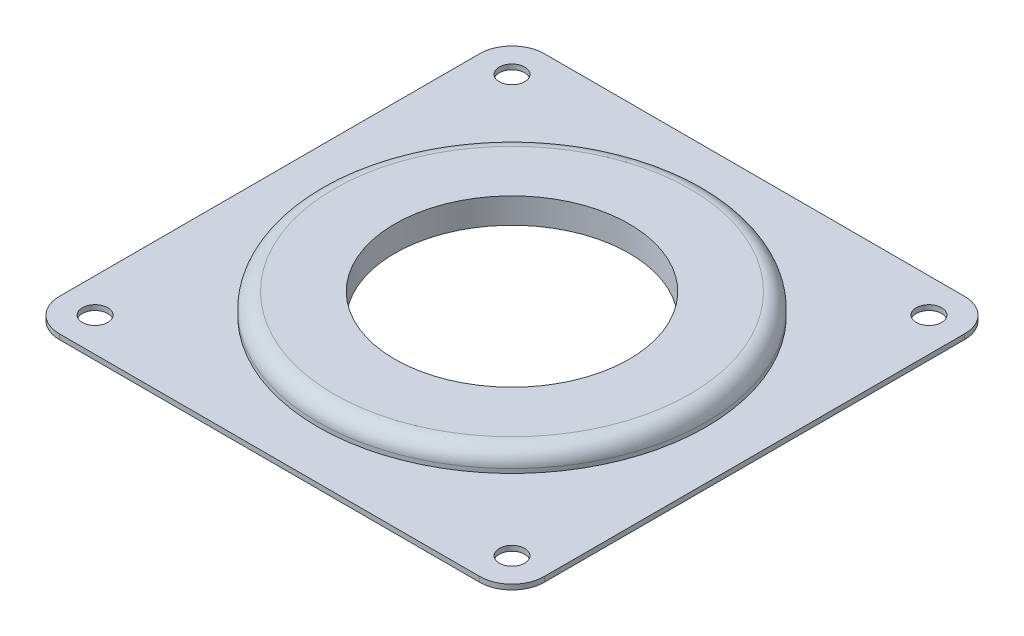
ISO-10303-21;
HEADER;
FILE_DESCRIPTION(('STEP AP214'),'2;1');
FILE_NAME('part.step','',(''),(''),'','','');
FILE_SCHEMA(('AUTOMOTIVE_DESIGN { 1 0 10303 214 1 1 1 1 }'));
ENDSEC;
DATA;
#1=APPLICATION_CONTEXT('core data for automotive mechanical design processes');
#2=APPLICATION_PROTOCOL_DEFINITION('international standard','automotive_design',2000,#1);
#3=PRODUCT_CONTEXT('',#1,'mechanical');
#4=PRODUCT('Part','Part','',(#3));
#5=PRODUCT_RELATED_PRODUCT_CATEGORY('part','',(#4));
#6=PRODUCT_DEFINITION_FORMATION('','',#4);
#7=PRODUCT_DEFINITION_CONTEXT('part definition',#1,'design');
#8=PRODUCT_DEFINITION('design','',#6,#7);
#9=PRODUCT_DEFINITION_SHAPE('','',#8);
#10=(LENGTH_UNIT() NAMED_UNIT(*) SI_UNIT(.MILLI.,.METRE.));
#11=(NAMED_UNIT(*) PLANE_ANGLE_UNIT() SI_UNIT($,.RADIAN.));
#12=(NAMED_UNIT(*) SI_UNIT($,.STERADIAN.) SOLID_ANGLE_UNIT());
#13=UNCERTAINTY_MEASURE_WITH_UNIT(LENGTH_MEASURE(1.E-05),#10,'distance_accuracy_value','');
#14=(GEOMETRIC_REPRESENTATION_CONTEXT(3) GLOBAL_UNCERTAINTY_ASSIGNED_CONTEXT((#13)) GLOBAL_UNIT_ASSIGNED_CONTEXT((#10,
#11,#12)) REPRESENTATION_CONTEXT('',''));
#15=CARTESIAN_POINT('',(0.,0.,0.));
#16=DIRECTION('',(0.,0.,1.));
#17=DIRECTION('',(1.,0.,0.));
#18=AXIS2_PLACEMENT_3D('',#15,#16,#17);
#19=CARTESIAN_POINT('',(0.,0.8,0.));
#20=DIRECTION('',(0.,-1.,0.));
#21=DIRECTION('',(0.,0.,-1.));
#22=AXIS2_PLACEMENT_3D('',#19,#20,#21);
#23=PLANE('',#22);
#24=CARTESIAN_POINT('',(0.,0.8,0.));
#25=DIRECTION('',(0.,1.,0.));
#26=DIRECTION('',(0.,0.,1.));
#27=AXIS2_PLACEMENT_3D('',#24,#25,#26);
#28=CIRCLE('',#27,30.48);
#29=CARTESIAN_POINT('',(0.,0.8,30.48));
#30=VERTEX_POINT('',#29);
#31=EDGE_CURVE('E163',#30,#30,#28,.T.);
#32=ORIENTED_EDGE('',*,*,#31,.F.);
#33=EDGE_LOOP('',(#32));
#34=FACE_BOUND('',#33,.T.);
#35=DIRECTION('',(0.,0.,-1.));
#36=VECTOR('',#35,1.);
#37=CARTESIAN_POINT('',(38.1,0.8,38.1));
#38=LINE('',#37,#36);
#39=CARTESIAN_POINT('',(38.1,0.8,33.02));
#40=VERTEX_POINT('',#39);
#41=CARTESIAN_POINT('',(38.1,0.8,-33.02));
#42=VERTEX_POINT('',#41);
#43=EDGE_CURVE('E139',#40,#42,#38,.T.);
#44=ORIENTED_EDGE('',*,*,#43,.T.);
#45=CARTESIAN_POINT('',(33.02,0.8,-33.02));
#46=DIRECTION('',(0.,-1.,0.));
#47=DIRECTION('',(0.,0.,-1.));
#48=AXIS2_PLACEMENT_3D('',#45,#46,#47);
#49=CIRCLE('',#48,5.08);
#50=CARTESIAN_POINT('',(33.02,0.8,-38.1));
#51=VERTEX_POINT('',#50);
#52=EDGE_CURVE('E153',#42,#51,#49,.F.);
#53=ORIENTED_EDGE('',*,*,#52,.T.);
#54=DIRECTION('',(-1.,0.,0.));
#55=VECTOR('',#54,1.);
#56=CARTESIAN_POINT('',(-38.1,0.8,-38.1));
#57=LINE('',#56,#55);
#58=CARTESIAN_POINT('',(-33.02,0.8,-38.1));
#59=VERTEX_POINT('',#58);
#60=EDGE_CURVE('E120',#51,#59,#57,.T.);
#61=ORIENTED_EDGE('',*,*,#60,.T.);
#62=CARTESIAN_POINT('',(-33.02,0.8,-33.02));
#63=DIRECTION('',(0.,-1.,0.));
#64=DIRECTION('',(0.,0.,-1.));
#65=AXIS2_PLACEMENT_3D('',#62,#63,#64);
#66=CIRCLE('',#65,5.08);
#67=CARTESIAN_POINT('',(-38.1,0.8,-33.02));
#68=VERTEX_POINT('',#67);
#69=EDGE_CURVE('E149',#59,#68,#66,.F.);
#70=ORIENTED_EDGE('',*,*,#69,.T.);
#71=DIRECTION('',(0.,0.,1.));
#72=VECTOR('',#71,1.);
#73=CARTESIAN_POINT('',(-38.1,0.8,38.1));
#74=LINE('',#73,#72);
#75=CARTESIAN_POINT('',(-38.1,0.8,33.02));
#76=VERTEX_POINT('',#75);
#77=EDGE_CURVE('E203',#68,#76,#74,.T.);
#78=ORIENTED_EDGE('',*,*,#77,.T.);
#79=CARTESIAN_POINT('',(-33.02,0.8,33.02));
#80=DIRECTION('',(0.,-1.,0.));
#81=DIRECTION('',(0.,0.,-1.));
#82=AXIS2_PLACEMENT_3D('',#79,#80,#81);
#83=CIRCLE('',#82,5.08);
#84=CARTESIAN_POINT('',(-33.02,0.8,38.1));
#85=VERTEX_POINT('',#84);
#86=EDGE_CURVE('E55',#76,#85,#83,.F.);
#87=ORIENTED_EDGE('',*,*,#86,.T.);
#88=DIRECTION('',(1.,0.,0.));
#89=VECTOR('',#88,1.);
#90=CARTESIAN_POINT('',(-38.1,0.8,38.1));
#91=LINE('',#90,#89);
#92=CARTESIAN_POINT('',(33.02,0.8,38.1));
#93=VERTEX_POINT('',#92);
#94=EDGE_CURVE('E140',#85,#93,#91,.T.);
#95=ORIENTED_EDGE('',*,*,#94,.T.);
#96=CARTESIAN_POINT('',(33.02,0.8,33.02));
#97=DIRECTION('',(0.,-1.,0.));
#98=DIRECTION('',(0.,0.,-1.));
#99=AXIS2_PLACEMENT_3D('',#96,#97,#98);
#100=CIRCLE('',#99,5.08);
#101=EDGE_CURVE('E151',#93,#40,#100,.F.);
#102=ORIENTED_EDGE('',*,*,#101,.T.);
#103=EDGE_LOOP('',(#44,#53,#61,#70,#78,#87,#95,#102));
#104=FACE_BOUND('',#103,.T.);
#105=CARTESIAN_POINT('',(-32.75,0.8,-32.75));
#106=DIRECTION('',(0.,1.,0.));
#107=DIRECTION('',(0.,0.,1.));
#108=AXIS2_PLACEMENT_3D('',#105,#106,#107);
#109=CIRCLE('',#108,2.000000064);
#110=CARTESIAN_POINT('',(-32.75,0.8,-30.749999936));
#111=VERTEX_POINT('',#110);
#112=EDGE_CURVE('E134',#111,#111,#109,.T.);
#113=ORIENTED_EDGE('',*,*,#112,.F.);
#114=EDGE_LOOP('',(#113));
#115=FACE_BOUND('',#114,.T.);
#116=CARTESIAN_POINT('',(32.75,0.8,-32.75));
#117=DIRECTION('',(0.,1.,0.));
#118=DIRECTION('',(0.,0.,1.));
#119=AXIS2_PLACEMENT_3D('',#116,#117,#118);
#120=CIRCLE('',#119,2.000000064);
#121=CARTESIAN_POINT('',(32.75,0.8,-30.749999936));
#122=VERTEX_POINT('',#121);
#123=EDGE_CURVE('E190',#122,#122,#120,.T.);
#124=ORIENTED_EDGE('',*,*,#123,.F.);
#125=EDGE_LOOP('',(#124));
#126=FACE_BOUND('',#125,.T.);
#127=CARTESIAN_POINT('',(32.75,0.8,32.75));
#128=DIRECTION('',(0.,1.,0.));
#129=DIRECTION('',(0.,0.,1.));
#130=AXIS2_PLACEMENT_3D('',#127,#128,#129);
#131=CIRCLE('',#130,2.000000064);
#132=CARTESIAN_POINT('',(32.75,0.8,34.750000064));
#133=VERTEX_POINT('',#132);
#134=EDGE_CURVE('E184',#133,#133,#131,.T.);
#135=ORIENTED_EDGE('',*,*,#134,.F.);
#136=EDGE_LOOP('',(#135));
#137=FACE_BOUND('',#136,.T.);
#138=CARTESIAN_POINT('',(-32.75,0.8,32.75));
#139=DIRECTION('',(0.,1.,0.));
#140=DIRECTION('',(0.,0.,1.));
#141=AXIS2_PLACEMENT_3D('',#138,#139,#140);
#142=CIRCLE('',#141,2.000000064);
#143=CARTESIAN_POINT('',(-32.75,0.8,34.750000064));
#144=VERTEX_POINT('',#143);
#145=EDGE_CURVE('E178',#144,#144,#142,.T.);
#146=ORIENTED_EDGE('',*,*,#145,.F.);
#147=EDGE_LOOP('',(#146));
#148=FACE_BOUND('',#147,.T.);
#149=ADVANCED_FACE('F33',(#34,#104,#115,#126,#137,#148),#23,.F.);
#150=CARTESIAN_POINT('',(0.,0.,0.));
#151=DIRECTION('',(0.,-1.,0.));
#152=DIRECTION('',(0.,0.,-1.));
#153=AXIS2_PLACEMENT_3D('',#150,#151,#152);
#154=PLANE('',#153);
#155=CARTESIAN_POINT('',(-32.75,0.,32.75));
#156=DIRECTION('',(0.,1.,0.));
#157=DIRECTION('',(0.,0.,1.));
#158=AXIS2_PLACEMENT_3D('',#155,#156,#157);
#159=CIRCLE('',#158,2.000000064);
#160=CARTESIAN_POINT('',(-32.75,0.,34.750000064));
#161=VERTEX_POINT('',#160);
#162=EDGE_CURVE('E177',#161,#161,#159,.T.);
#163=ORIENTED_EDGE('',*,*,#162,.T.);
#164=EDGE_LOOP('',(#163));
#165=FACE_BOUND('',#164,.T.);
#166=CARTESIAN_POINT('',(32.75,0.,-32.75));
#167=DIRECTION('',(0.,1.,0.));
#168=DIRECTION('',(0.,0.,1.));
#169=AXIS2_PLACEMENT_3D('',#166,#167,#168);
#170=CIRCLE('',#169,2.000000064);
#171=CARTESIAN_POINT('',(32.75,0.,-30.749999936));
#172=VERTEX_POINT('',#171);
#173=EDGE_CURVE('E187',#172,#172,#170,.T.);
#174=ORIENTED_EDGE('',*,*,#173,.T.);
#175=EDGE_LOOP('',(#174));
#176=FACE_BOUND('',#175,.T.);
#177=DIRECTION('',(-1.,0.,0.));
#178=VECTOR('',#177,1.);
#179=CARTESIAN_POINT('',(-38.1,0.,-38.1));
#180=LINE('',#179,#178);
#181=CARTESIAN_POINT('',(33.02,0.,-38.1));
#182=VERTEX_POINT('',#181);
#183=CARTESIAN_POINT('',(-33.02,0.,-38.1));
#184=VERTEX_POINT('',#183);
#185=EDGE_CURVE('E117',#182,#184,#180,.T.);
#186=ORIENTED_EDGE('',*,*,#185,.F.);
#187=CARTESIAN_POINT('',(33.02,0.,-33.02));
#188=DIRECTION('',(0.,-1.,0.));
#189=DIRECTION('',(0.,0.,-1.));
#190=AXIS2_PLACEMENT_3D('',#187,#188,#189);
#191=CIRCLE('',#190,5.08);
#192=CARTESIAN_POINT('',(38.1,0.,-33.02));
#193=VERTEX_POINT('',#192);
#194=EDGE_CURVE('E100',#182,#193,#191,.T.);
#195=ORIENTED_EDGE('',*,*,#194,.T.);
#196=DIRECTION('',(0.,0.,-1.));
#197=VECTOR('',#196,1.);
#198=CARTESIAN_POINT('',(38.1,0.,38.1));
#199=LINE('',#198,#197);
#200=CARTESIAN_POINT('',(38.1,0.,33.02));
#201=VERTEX_POINT('',#200);
#202=EDGE_CURVE('E129',#201,#193,#199,.T.);
#203=ORIENTED_EDGE('',*,*,#202,.F.);
#204=CARTESIAN_POINT('',(33.02,0.,33.02));
#205=DIRECTION('',(0.,-1.,0.));
#206=DIRECTION('',(0.,0.,-1.));
#207=AXIS2_PLACEMENT_3D('',#204,#205,#206);
#208=CIRCLE('',#207,5.08);
#209=CARTESIAN_POINT('',(33.02,0.,38.1));
#210=VERTEX_POINT('',#209);
#211=EDGE_CURVE('E111',#201,#210,#208,.T.);
#212=ORIENTED_EDGE('',*,*,#211,.T.);
#213=DIRECTION('',(1.,0.,0.));
#214=VECTOR('',#213,1.);
#215=CARTESIAN_POINT('',(-38.1,0.,38.1));
#216=LINE('',#215,#214);
#217=CARTESIAN_POINT('',(-33.02,0.,38.1));
#218=VERTEX_POINT('',#217);
#219=EDGE_CURVE('E132',#218,#210,#216,.T.);
#220=ORIENTED_EDGE('',*,*,#219,.F.);
#221=CARTESIAN_POINT('',(-33.02,0.,33.02));
#222=DIRECTION('',(0.,-1.,0.));
#223=DIRECTION('',(0.,0.,-1.));
#224=AXIS2_PLACEMENT_3D('',#221,#222,#223);
#225=CIRCLE('',#224,5.08);
#226=CARTESIAN_POINT('',(-38.1,0.,33.02));
#227=VERTEX_POINT('',#226);
#228=EDGE_CURVE('E121',#218,#227,#225,.T.);
#229=ORIENTED_EDGE('',*,*,#228,.T.);
#230=DIRECTION('',(0.,0.,1.));
#231=VECTOR('',#230,1.);
#232=CARTESIAN_POINT('',(-38.1,0.,38.1));
#233=LINE('',#232,#231);
#234=CARTESIAN_POINT('',(-38.1,0.,-33.02));
#235=VERTEX_POINT('',#234);
#236=EDGE_CURVE('E128',#235,#227,#233,.T.);
#237=ORIENTED_EDGE('',*,*,#236,.F.);
#238=CARTESIAN_POINT('',(-33.02,0.,-33.02));
#239=DIRECTION('',(0.,-1.,0.));
#240=DIRECTION('',(0.,0.,-1.));
#241=AXIS2_PLACEMENT_3D('',#238,#239,#240);
#242=CIRCLE('',#241,5.08);
#243=EDGE_CURVE('E127',#235,#184,#242,.T.);
#244=ORIENTED_EDGE('',*,*,#243,.T.);
#245=EDGE_LOOP('',(#186,#195,#203,#212,#220,#229,#237,#244));
#246=FACE_BOUND('',#245,.T.);
#247=CARTESIAN_POINT('',(-32.75,0.,-32.75));
#248=DIRECTION('',(0.,1.,0.));
#249=DIRECTION('',(0.,0.,1.));
#250=AXIS2_PLACEMENT_3D('',#247,#248,#249);
#251=CIRCLE('',#250,2.000000064);
#252=CARTESIAN_POINT('',(-32.75,0.,-30.749999936));
#253=VERTEX_POINT('',#252);
#254=EDGE_CURVE('E193',#253,#253,#251,.T.);
#255=ORIENTED_EDGE('',*,*,#254,.T.);
#256=EDGE_LOOP('',(#255));
#257=FACE_BOUND('',#256,.T.);
#258=CARTESIAN_POINT('',(32.75,0.,32.75));
#259=DIRECTION('',(0.,1.,0.));
#260=DIRECTION('',(0.,0.,1.));
#261=AXIS2_PLACEMENT_3D('',#258,#259,#260);
#262=CIRCLE('',#261,2.000000064);
#263=CARTESIAN_POINT('',(32.75,0.,34.750000064));
#264=VERTEX_POINT('',#263);
#265=EDGE_CURVE('E181',#264,#264,#262,.T.);
#266=ORIENTED_EDGE('',*,*,#265,.T.);
#267=EDGE_LOOP('',(#266));
#268=FACE_BOUND('',#267,.T.);
#269=CARTESIAN_POINT('',(0.,0.,0.));
#270=DIRECTION('',(0.,1.,0.));
#271=DIRECTION('',(0.,0.,1.));
#272=AXIS2_PLACEMENT_3D('',#269,#270,#271);
#273=CIRCLE('',#272,18.415);
#274=CARTESIAN_POINT('',(0.,0.,18.415));
#275=VERTEX_POINT('',#274);
#276=EDGE_CURVE('E174',#275,#275,#273,.T.);
#277=ORIENTED_EDGE('',*,*,#276,.T.);
#278=EDGE_LOOP('',(#277));
#279=FACE_BOUND('',#278,.T.);
#280=ADVANCED_FACE('F124',(#165,#176,#246,#257,#268,#279),#154,.T.);
#281=CARTESIAN_POINT('',(38.1,0.8,38.1));
#282=DIRECTION('',(-1.,0.,0.));
#283=DIRECTION('',(0.,0.,1.));
#284=AXIS2_PLACEMENT_3D('',#281,#282,#283);
#285=PLANE('',#284);
#286=ORIENTED_EDGE('',*,*,#202,.T.);
#287=DIRECTION('',(0.,-1.,0.));
#288=VECTOR('',#287,1.);
#289=CARTESIAN_POINT('',(38.1,0.8,-33.02));
#290=LINE('',#289,#288);
#291=EDGE_CURVE('E105',#193,#42,#290,.F.);
#292=ORIENTED_EDGE('',*,*,#291,.T.);
#293=ORIENTED_EDGE('',*,*,#43,.F.);
#294=DIRECTION('',(0.,-1.,0.));
#295=VECTOR('',#294,1.);
#296=CARTESIAN_POINT('',(38.1,0.8,33.02));
#297=LINE('',#296,#295);
#298=EDGE_CURVE('E110',#40,#201,#297,.T.);
#299=ORIENTED_EDGE('',*,*,#298,.T.);
#300=EDGE_LOOP('',(#286,#292,#293,#299));
#301=FACE_BOUND('',#300,.T.);
#302=ADVANCED_FACE('F212',(#301),#285,.F.);
#303=CARTESIAN_POINT('',(-38.1,0.8,-38.1));
#304=DIRECTION('',(0.,0.,1.));
#305=DIRECTION('',(1.,0.,0.));
#306=AXIS2_PLACEMENT_3D('',#303,#304,#305);
#307=PLANE('',#306);
#308=ORIENTED_EDGE('',*,*,#60,.F.);
#309=DIRECTION('',(0.,-1.,0.));
#310=VECTOR('',#309,1.);
#311=CARTESIAN_POINT('',(33.02,0.8,-38.1));
#312=LINE('',#311,#310);
#313=EDGE_CURVE('E104',#51,#182,#312,.T.);
#314=ORIENTED_EDGE('',*,*,#313,.T.);
#315=ORIENTED_EDGE('',*,*,#185,.T.);
#316=DIRECTION('',(0.,-1.,0.));
#317=VECTOR('',#316,1.);
#318=CARTESIAN_POINT('',(-33.02,0.8,-38.1));
#319=LINE('',#318,#317);
#320=EDGE_CURVE('E122',#184,#59,#319,.F.);
#321=ORIENTED_EDGE('',*,*,#320,.T.);
#322=EDGE_LOOP('',(#308,#314,#315,#321));
#323=FACE_BOUND('',#322,.T.);
#324=ADVANCED_FACE('F116',(#323),#307,.F.);
#325=CARTESIAN_POINT('',(-38.1,0.8,38.1));
#326=DIRECTION('',(1.,0.,0.));
#327=DIRECTION('',(0.,0.,-1.));
#328=AXIS2_PLACEMENT_3D('',#325,#326,#327);
#329=PLANE('',#328);
#330=ORIENTED_EDGE('',*,*,#77,.F.);
#331=DIRECTION('',(0.,-1.,0.));
#332=VECTOR('',#331,1.);
#333=CARTESIAN_POINT('',(-38.1,0.8,-33.02));
#334=LINE('',#333,#332);
#335=EDGE_CURVE('E161',#68,#235,#334,.T.);
#336=ORIENTED_EDGE('',*,*,#335,.T.);
#337=ORIENTED_EDGE('',*,*,#236,.T.);
#338=DIRECTION('',(0.,-1.,0.));
#339=VECTOR('',#338,1.);
#340=CARTESIAN_POINT('',(-38.1,0.8,33.02));
#341=LINE('',#340,#339);
#342=EDGE_CURVE('E159',#227,#76,#341,.F.);
#343=ORIENTED_EDGE('',*,*,#342,.T.);
#344=EDGE_LOOP('',(#330,#336,#337,#343));
#345=FACE_BOUND('',#344,.T.);
#346=ADVANCED_FACE('F220',(#345),#329,.F.);
#347=CARTESIAN_POINT('',(-38.1,0.8,38.1));
#348=DIRECTION('',(0.,0.,-1.));
#349=DIRECTION('',(-1.,0.,0.));
#350=AXIS2_PLACEMENT_3D('',#347,#348,#349);
#351=PLANE('',#350);
#352=ORIENTED_EDGE('',*,*,#219,.T.);
#353=DIRECTION('',(0.,-1.,0.));
#354=VECTOR('',#353,1.);
#355=CARTESIAN_POINT('',(33.02,0.8,38.1));
#356=LINE('',#355,#354);
#357=EDGE_CURVE('E48',#210,#93,#356,.F.);
#358=ORIENTED_EDGE('',*,*,#357,.T.);
#359=ORIENTED_EDGE('',*,*,#94,.F.);
#360=DIRECTION('',(0.,-1.,0.));
#361=VECTOR('',#360,1.);
#362=CARTESIAN_POINT('',(-33.02,0.8,38.1));
#363=LINE('',#362,#361);
#364=EDGE_CURVE('E155',#85,#218,#363,.T.);
#365=ORIENTED_EDGE('',*,*,#364,.T.);
#366=EDGE_LOOP('',(#352,#358,#359,#365));
#367=FACE_BOUND('',#366,.T.);
#368=ADVANCED_FACE('F214',(#367),#351,.F.);
#369=CARTESIAN_POINT('',(-32.75,0.8,-32.75));
#370=DIRECTION('',(0.,-1.,0.));
#371=DIRECTION('',(0.,0.,-1.));
#372=AXIS2_PLACEMENT_3D('',#369,#370,#371);
#373=CYLINDRICAL_SURFACE('',#372,2.000000064);
#374=ORIENTED_EDGE('',*,*,#112,.T.);
#375=EDGE_LOOP('',(#374));
#376=FACE_BOUND('',#375,.T.);
#377=ORIENTED_EDGE('',*,*,#254,.F.);
#378=EDGE_LOOP('',(#377));
#379=FACE_BOUND('',#378,.T.);
#380=ADVANCED_FACE('F242',(#376,#379),#373,.F.);
#381=CARTESIAN_POINT('',(32.75,0.8,-32.75));
#382=DIRECTION('',(0.,-1.,0.));
#383=DIRECTION('',(0.,0.,-1.));
#384=AXIS2_PLACEMENT_3D('',#381,#382,#383);
#385=CYLINDRICAL_SURFACE('',#384,2.000000064);
#386=ORIENTED_EDGE('',*,*,#123,.T.);
#387=EDGE_LOOP('',(#386));
#388=FACE_BOUND('',#387,.T.);
#389=ORIENTED_EDGE('',*,*,#173,.F.);
#390=EDGE_LOOP('',(#389));
#391=FACE_BOUND('',#390,.T.);
#392=ADVANCED_FACE('F274',(#388,#391),#385,.F.);
#393=CARTESIAN_POINT('',(32.75,0.8,32.75));
#394=DIRECTION('',(0.,-1.,0.));
#395=DIRECTION('',(0.,0.,-1.));
#396=AXIS2_PLACEMENT_3D('',#393,#394,#395);
#397=CYLINDRICAL_SURFACE('',#396,2.000000064);
#398=ORIENTED_EDGE('',*,*,#134,.T.);
#399=EDGE_LOOP('',(#398));
#400=FACE_BOUND('',#399,.T.);
#401=ORIENTED_EDGE('',*,*,#265,.F.);
#402=EDGE_LOOP('',(#401));
#403=FACE_BOUND('',#402,.T.);
#404=ADVANCED_FACE('F264',(#400,#403),#397,.F.);
#405=CARTESIAN_POINT('',(-32.75,0.8,32.75));
#406=DIRECTION('',(0.,-1.,0.));
#407=DIRECTION('',(0.,0.,-1.));
#408=AXIS2_PLACEMENT_3D('',#405,#406,#407);
#409=CYLINDRICAL_SURFACE('',#408,2.000000064);
#410=ORIENTED_EDGE('',*,*,#145,.T.);
#411=EDGE_LOOP('',(#410));
#412=FACE_BOUND('',#411,.T.);
#413=ORIENTED_EDGE('',*,*,#162,.F.);
#414=EDGE_LOOP('',(#413));
#415=FACE_BOUND('',#414,.T.);
#416=ADVANCED_FACE('F258',(#412,#415),#409,.F.);
#417=CARTESIAN_POINT('',(0.,0.8,0.));
#418=DIRECTION('',(0.,-1.,0.));
#419=DIRECTION('',(0.,0.,-1.));
#420=AXIS2_PLACEMENT_3D('',#417,#418,#419);
#421=CYLINDRICAL_SURFACE('',#420,18.415);
#422=ORIENTED_EDGE('',*,*,#276,.F.);
#423=EDGE_LOOP('',(#422));
#424=FACE_BOUND('',#423,.T.);
#425=CARTESIAN_POINT('',(0.,4.,0.));
#426=DIRECTION('',(0.,1.,0.));
#427=DIRECTION('',(0.,0.,1.));
#428=AXIS2_PLACEMENT_3D('',#425,#426,#427);
#429=CIRCLE('',#428,18.415);
#430=CARTESIAN_POINT('',(0.,4.,18.415));
#431=VERTEX_POINT('',#430);
#432=EDGE_CURVE('E173',#431,#431,#429,.T.);
#433=ORIENTED_EDGE('',*,*,#432,.T.);
#434=EDGE_LOOP('',(#433));
#435=FACE_BOUND('',#434,.T.);
#436=ADVANCED_FACE('F254',(#424,#435),#421,.F.);
#437=CARTESIAN_POINT('',(33.02,0.8,-33.02));
#438=DIRECTION('',(0.,-1.,0.));
#439=DIRECTION('',(0.,0.,-1.));
#440=AXIS2_PLACEMENT_3D('',#437,#438,#439);
#441=CYLINDRICAL_SURFACE('',#440,5.08);
#442=ORIENTED_EDGE('',*,*,#52,.F.);
#443=ORIENTED_EDGE('',*,*,#291,.F.);
#444=ORIENTED_EDGE('',*,*,#194,.F.);
#445=ORIENTED_EDGE('',*,*,#313,.F.);
#446=EDGE_LOOP('',(#442,#443,#444,#445));
#447=FACE_BOUND('',#446,.T.);
#448=ADVANCED_FACE('F103',(#447),#441,.T.);
#449=CARTESIAN_POINT('',(33.02,0.8,33.02));
#450=DIRECTION('',(0.,-1.,0.));
#451=DIRECTION('',(0.,0.,-1.));
#452=AXIS2_PLACEMENT_3D('',#449,#450,#451);
#453=CYLINDRICAL_SURFACE('',#452,5.08);
#454=ORIENTED_EDGE('',*,*,#101,.F.);
#455=ORIENTED_EDGE('',*,*,#357,.F.);
#456=ORIENTED_EDGE('',*,*,#211,.F.);
#457=ORIENTED_EDGE('',*,*,#298,.F.);
#458=EDGE_LOOP('',(#454,#455,#456,#457));
#459=FACE_BOUND('',#458,.T.);
#460=ADVANCED_FACE('F210',(#459),#453,.T.);
#461=CARTESIAN_POINT('',(-33.02,0.8,-33.02));
#462=DIRECTION('',(0.,-1.,0.));
#463=DIRECTION('',(0.,0.,-1.));
#464=AXIS2_PLACEMENT_3D('',#461,#462,#463);
#465=CYLINDRICAL_SURFACE('',#464,5.08);
#466=ORIENTED_EDGE('',*,*,#69,.F.);
#467=ORIENTED_EDGE('',*,*,#320,.F.);
#468=ORIENTED_EDGE('',*,*,#243,.F.);
#469=ORIENTED_EDGE('',*,*,#335,.F.);
#470=EDGE_LOOP('',(#466,#467,#468,#469));
#471=FACE_BOUND('',#470,.T.);
#472=ADVANCED_FACE('F224',(#471),#465,.T.);
#473=CARTESIAN_POINT('',(-33.02,0.8,33.02));
#474=DIRECTION('',(0.,-1.,0.));
#475=DIRECTION('',(0.,0.,-1.));
#476=AXIS2_PLACEMENT_3D('',#473,#474,#475);
#477=CYLINDRICAL_SURFACE('',#476,5.08);
#478=ORIENTED_EDGE('',*,*,#86,.F.);
#479=ORIENTED_EDGE('',*,*,#342,.F.);
#480=ORIENTED_EDGE('',*,*,#228,.F.);
#481=ORIENTED_EDGE('',*,*,#364,.F.);
#482=EDGE_LOOP('',(#478,#479,#480,#481));
#483=FACE_BOUND('',#482,.T.);
#484=ADVANCED_FACE('F216',(#483),#477,.T.);
#485=CARTESIAN_POINT('',(0.,4.,0.));
#486=DIRECTION('',(0.,1.,0.));
#487=DIRECTION('',(0.,0.,1.));
#488=AXIS2_PLACEMENT_3D('',#485,#486,#487);
#489=PLANE('',#488);
#490=CARTESIAN_POINT('',(0.,4.,0.));
#491=DIRECTION('',(0.,1.,0.));
#492=DIRECTION('',(0.,0.,1.));
#493=AXIS2_PLACEMENT_3D('',#490,#491,#492);
#494=CIRCLE('',#493,27.94);
#495=CARTESIAN_POINT('',(0.,4.,27.94));
#496=VERTEX_POINT('',#495);
#497=EDGE_CURVE('E41',#496,#496,#494,.T.);
#498=ORIENTED_EDGE('',*,*,#497,.T.);
#499=EDGE_LOOP('',(#498));
#500=FACE_BOUND('',#499,.T.);
#501=ORIENTED_EDGE('',*,*,#432,.F.);
#502=EDGE_LOOP('',(#501));
#503=FACE_BOUND('',#502,.T.);
#504=ADVANCED_FACE('F231',(#500,#503),#489,.T.);
#505=CARTESIAN_POINT('',(0.,4.,0.));
#506=DIRECTION('',(0.,-1.,0.));
#507=DIRECTION('',(0.,0.,-1.));
#508=AXIS2_PLACEMENT_3D('',#505,#506,#507);
#509=CYLINDRICAL_SURFACE('',#508,30.48);
#510=CARTESIAN_POINT('',(0.,1.46,0.));
#511=DIRECTION('',(0.,1.,0.));
#512=DIRECTION('',(0.,0.,1.));
#513=AXIS2_PLACEMENT_3D('',#510,#511,#512);
#514=CIRCLE('',#513,30.48);
#515=CARTESIAN_POINT('',(0.,1.46,30.48));
#516=VERTEX_POINT('',#515);
#517=EDGE_CURVE('E11',#516,#516,#514,.F.);
#518=ORIENTED_EDGE('',*,*,#517,.T.);
#519=EDGE_LOOP('',(#518));
#520=FACE_BOUND('',#519,.T.);
#521=ORIENTED_EDGE('',*,*,#31,.T.);
#522=EDGE_LOOP('',(#521));
#523=FACE_BOUND('',#522,.T.);
#524=ADVANCED_FACE('F270',(#520,#523),#509,.T.);
#525=CARTESIAN_POINT('',(0.,1.46,0.));
#526=DIRECTION('',(0.,1.,0.));
#527=DIRECTION('',(0.,0.,1.));
#528=AXIS2_PLACEMENT_3D('',#525,#526,#527);
#529=TOROIDAL_SURFACE('',#528,27.94,2.54);
#530=ORIENTED_EDGE('',*,*,#517,.F.);
#531=EDGE_LOOP('',(#530));
#532=FACE_BOUND('',#531,.T.);
#533=ORIENTED_EDGE('',*,*,#497,.F.);
#534=EDGE_LOOP('',(#533));
#535=FACE_BOUND('',#534,.T.);
#536=ADVANCED_FACE('F35',(#532,#535),#529,.T.);
#537=CLOSED_SHELL('',(#149,#280,#302,#324,#346,#368,#380,#392,#404,#416,#436,#448,#460,#472,
#484,#504,#524,#536));
#538=MANIFOLD_SOLID_BREP('B2',#537);
#539=ADVANCED_BREP_SHAPE_REPRESENTATION('',(#18,#538),#14);
#540=SHAPE_DEFINITION_REPRESENTATION(#9,#539);
ENDSEC;
END-ISO-10303-21;
